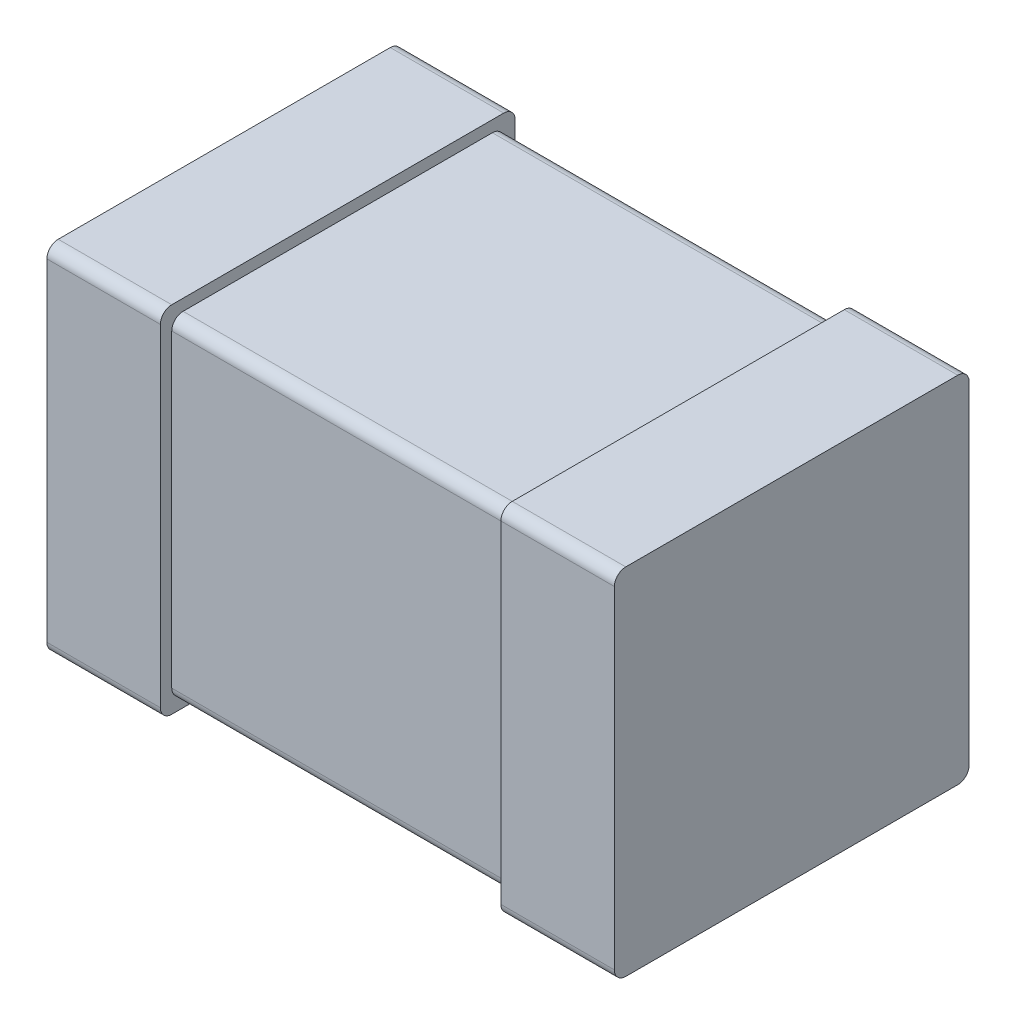
ISO-10303-21;
HEADER;
FILE_DESCRIPTION(('STEP AP214'),'2;1');
FILE_NAME('part.step','',(''),(''),'','','');
FILE_SCHEMA(('AUTOMOTIVE_DESIGN { 1 0 10303 214 1 1 1 1 }'));
ENDSEC;
DATA;
#1=APPLICATION_CONTEXT('core data for automotive mechanical design processes');
#2=APPLICATION_PROTOCOL_DEFINITION('international standard','automotive_design',2000,#1);
#3=PRODUCT_CONTEXT('',#1,'mechanical');
#4=PRODUCT('Part','Part','',(#3));
#5=PRODUCT_RELATED_PRODUCT_CATEGORY('part','',(#4));
#6=PRODUCT_DEFINITION_FORMATION('','',#4);
#7=PRODUCT_DEFINITION_CONTEXT('part definition',#1,'design');
#8=PRODUCT_DEFINITION('design','',#6,#7);
#9=PRODUCT_DEFINITION_SHAPE('','',#8);
#10=(LENGTH_UNIT() NAMED_UNIT(*) SI_UNIT(.MILLI.,.METRE.));
#11=(NAMED_UNIT(*) PLANE_ANGLE_UNIT() SI_UNIT($,.RADIAN.));
#12=(NAMED_UNIT(*) SI_UNIT($,.STERADIAN.) SOLID_ANGLE_UNIT());
#13=UNCERTAINTY_MEASURE_WITH_UNIT(LENGTH_MEASURE(1.E-05),#10,'distance_accuracy_value','');
#14=(GEOMETRIC_REPRESENTATION_CONTEXT(3) GLOBAL_UNCERTAINTY_ASSIGNED_CONTEXT((#13)) GLOBAL_UNIT_ASSIGNED_CONTEXT((#10,
#11,#12)) REPRESENTATION_CONTEXT('',''));
#15=CARTESIAN_POINT('',(0.,0.,0.));
#16=DIRECTION('',(0.,0.,1.));
#17=DIRECTION('',(1.,0.,0.));
#18=AXIS2_PLACEMENT_3D('',#15,#16,#17);
#19=CARTESIAN_POINT('',(-1.,-0.625,0.));
#20=DIRECTION('',(1.,0.,0.));
#21=DIRECTION('',(0.,1.,0.));
#22=AXIS2_PLACEMENT_3D('',#19,#20,#21);
#23=PLANE('',#22);
#24=CARTESIAN_POINT('',(-1.,-0.585,1.21));
#25=DIRECTION('',(-1.,0.,0.));
#26=DIRECTION('',(0.,0.,1.));
#27=AXIS2_PLACEMENT_3D('',#24,#25,#26);
#28=CIRCLE('',#27,0.04);
#29=CARTESIAN_POINT('',(-1.,-0.625,1.21));
#30=VERTEX_POINT('',#29);
#31=CARTESIAN_POINT('',(-1.,-0.585,1.25));
#32=VERTEX_POINT('',#31);
#33=EDGE_CURVE('E11',#30,#32,#28,.T.);
#34=ORIENTED_EDGE('',*,*,#33,.T.);
#35=DIRECTION('',(0.,1.,0.));
#36=VECTOR('',#35,1.);
#37=CARTESIAN_POINT('',(-1.,-0.625,1.25));
#38=LINE('',#37,#36);
#39=CARTESIAN_POINT('',(-1.,0.585,1.25));
#40=VERTEX_POINT('',#39);
#41=EDGE_CURVE('E27',#32,#40,#38,.T.);
#42=ORIENTED_EDGE('',*,*,#41,.T.);
#43=CARTESIAN_POINT('',(-1.,0.585,1.21));
#44=DIRECTION('',(1.,0.,0.));
#45=DIRECTION('',(0.,0.,1.));
#46=AXIS2_PLACEMENT_3D('',#43,#44,#45);
#47=CIRCLE('',#46,0.04);
#48=CARTESIAN_POINT('',(-1.,0.625,1.21));
#49=VERTEX_POINT('',#48);
#50=EDGE_CURVE('E371',#49,#40,#47,.T.);
#51=ORIENTED_EDGE('',*,*,#50,.F.);
#52=DIRECTION('',(0.,0.,1.));
#53=VECTOR('',#52,1.);
#54=CARTESIAN_POINT('',(-1.,0.625,0.));
#55=LINE('',#54,#53);
#56=CARTESIAN_POINT('',(-1.,0.625,0.04));
#57=VERTEX_POINT('',#56);
#58=EDGE_CURVE('E286',#57,#49,#55,.T.);
#59=ORIENTED_EDGE('',*,*,#58,.F.);
#60=CARTESIAN_POINT('',(-1.,0.585,0.04));
#61=DIRECTION('',(-1.,0.,0.));
#62=DIRECTION('',(0.,0.,1.));
#63=AXIS2_PLACEMENT_3D('',#60,#61,#62);
#64=CIRCLE('',#63,0.04);
#65=CARTESIAN_POINT('',(-1.,0.585,0.));
#66=VERTEX_POINT('',#65);
#67=EDGE_CURVE('E426',#57,#66,#64,.T.);
#68=ORIENTED_EDGE('',*,*,#67,.T.);
#69=DIRECTION('',(0.,1.,0.));
#70=VECTOR('',#69,1.);
#71=CARTESIAN_POINT('',(-1.,-0.625,0.));
#72=LINE('',#71,#70);
#73=CARTESIAN_POINT('',(-1.,-0.585,0.));
#74=VERTEX_POINT('',#73);
#75=EDGE_CURVE('E382',#74,#66,#72,.T.);
#76=ORIENTED_EDGE('',*,*,#75,.F.);
#77=CARTESIAN_POINT('',(-1.,-0.585,0.04));
#78=DIRECTION('',(1.,0.,0.));
#79=DIRECTION('',(0.,0.,1.));
#80=AXIS2_PLACEMENT_3D('',#77,#78,#79);
#81=CIRCLE('',#80,0.04);
#82=CARTESIAN_POINT('',(-1.,-0.625,0.04));
#83=VERTEX_POINT('',#82);
#84=EDGE_CURVE('E152',#83,#74,#81,.T.);
#85=ORIENTED_EDGE('',*,*,#84,.F.);
#86=DIRECTION('',(0.,0.,1.));
#87=VECTOR('',#86,1.);
#88=CARTESIAN_POINT('',(-1.,-0.625,0.));
#89=LINE('',#88,#87);
#90=EDGE_CURVE('E159',#83,#30,#89,.T.);
#91=ORIENTED_EDGE('',*,*,#90,.T.);
#92=EDGE_LOOP('',(#34,#42,#51,#59,#68,#76,#85,#91));
#93=FACE_BOUND('',#92,.T.);
#94=ADVANCED_FACE('F16',(#93),#23,.F.);
#95=CARTESIAN_POINT('',(-1.,-0.625,0.));
#96=DIRECTION('',(0.,1.,0.));
#97=DIRECTION('',(1.,0.,0.));
#98=AXIS2_PLACEMENT_3D('',#95,#96,#97);
#99=PLANE('',#98);
#100=DIRECTION('',(1.,0.,0.));
#101=VECTOR('',#100,1.);
#102=CARTESIAN_POINT('',(-1.,-0.625,1.21));
#103=LINE('',#102,#101);
#104=CARTESIAN_POINT('',(-0.6,-0.625,1.21));
#105=VERTEX_POINT('',#104);
#106=EDGE_CURVE('E338',#30,#105,#103,.T.);
#107=ORIENTED_EDGE('',*,*,#106,.F.);
#108=ORIENTED_EDGE('',*,*,#90,.F.);
#109=DIRECTION('',(1.,0.,0.));
#110=VECTOR('',#109,1.);
#111=CARTESIAN_POINT('',(-1.,-0.625,0.04));
#112=LINE('',#111,#110);
#113=CARTESIAN_POINT('',(-0.6,-0.625,0.04));
#114=VERTEX_POINT('',#113);
#115=EDGE_CURVE('E284',#83,#114,#112,.T.);
#116=ORIENTED_EDGE('',*,*,#115,.T.);
#117=DIRECTION('',(0.,0.,1.));
#118=VECTOR('',#117,1.);
#119=CARTESIAN_POINT('',(-0.6,-0.625,0.));
#120=LINE('',#119,#118);
#121=EDGE_CURVE('E340',#114,#105,#120,.T.);
#122=ORIENTED_EDGE('',*,*,#121,.T.);
#123=EDGE_LOOP('',(#107,#108,#116,#122));
#124=FACE_BOUND('',#123,.T.);
#125=ADVANCED_FACE('F547',(#124),#99,.F.);
#126=CARTESIAN_POINT('',(-1.,-0.585,0.04));
#127=DIRECTION('',(1.,0.,0.));
#128=DIRECTION('',(0.,-1.,0.));
#129=AXIS2_PLACEMENT_3D('',#126,#127,#128);
#130=CYLINDRICAL_SURFACE('',#129,0.04);
#131=ORIENTED_EDGE('',*,*,#84,.T.);
#132=DIRECTION('',(1.,0.,0.));
#133=VECTOR('',#132,1.);
#134=CARTESIAN_POINT('',(-1.,-0.585,0.));
#135=LINE('',#134,#133);
#136=CARTESIAN_POINT('',(-0.6,-0.585,0.));
#137=VERTEX_POINT('',#136);
#138=EDGE_CURVE('E334',#74,#137,#135,.T.);
#139=ORIENTED_EDGE('',*,*,#138,.T.);
#140=CARTESIAN_POINT('',(-0.6,-0.585,0.04));
#141=DIRECTION('',(1.,0.,0.));
#142=DIRECTION('',(0.,0.,1.));
#143=AXIS2_PLACEMENT_3D('',#140,#141,#142);
#144=CIRCLE('',#143,0.04);
#145=EDGE_CURVE('E386',#114,#137,#144,.T.);
#146=ORIENTED_EDGE('',*,*,#145,.F.);
#147=ORIENTED_EDGE('',*,*,#115,.F.);
#148=EDGE_LOOP('',(#131,#139,#146,#147));
#149=FACE_BOUND('',#148,.T.);
#150=ADVANCED_FACE('F18',(#149),#130,.T.);
#151=CARTESIAN_POINT('',(-1.,-0.585,1.21));
#152=DIRECTION('',(1.,0.,0.));
#153=DIRECTION('',(0.,-1.,0.));
#154=AXIS2_PLACEMENT_3D('',#151,#152,#153);
#155=CYLINDRICAL_SURFACE('',#154,0.04);
#156=ORIENTED_EDGE('',*,*,#106,.T.);
#157=CARTESIAN_POINT('',(-0.6,-0.585,1.21));
#158=DIRECTION('',(-1.,0.,0.));
#159=DIRECTION('',(0.,0.,1.));
#160=AXIS2_PLACEMENT_3D('',#157,#158,#159);
#161=CIRCLE('',#160,0.04);
#162=CARTESIAN_POINT('',(-0.6,-0.585,1.25));
#163=VERTEX_POINT('',#162);
#164=EDGE_CURVE('E381',#105,#163,#161,.T.);
#165=ORIENTED_EDGE('',*,*,#164,.T.);
#166=DIRECTION('',(1.,0.,0.));
#167=VECTOR('',#166,1.);
#168=CARTESIAN_POINT('',(-1.,-0.585,1.25));
#169=LINE('',#168,#167);
#170=EDGE_CURVE('E523',#32,#163,#169,.T.);
#171=ORIENTED_EDGE('',*,*,#170,.F.);
#172=ORIENTED_EDGE('',*,*,#33,.F.);
#173=EDGE_LOOP('',(#156,#165,#171,#172));
#174=FACE_BOUND('',#173,.T.);
#175=ADVANCED_FACE('F545',(#174),#155,.T.);
#176=CARTESIAN_POINT('',(-1.,-0.625,0.));
#177=DIRECTION('',(0.,0.,1.));
#178=DIRECTION('',(1.,0.,0.));
#179=AXIS2_PLACEMENT_3D('',#176,#177,#178);
#180=PLANE('',#179);
#181=DIRECTION('',(1.,0.,0.));
#182=VECTOR('',#181,1.);
#183=CARTESIAN_POINT('',(-1.,0.585,0.));
#184=LINE('',#183,#182);
#185=CARTESIAN_POINT('',(-0.6,0.585,0.));
#186=VERTEX_POINT('',#185);
#187=EDGE_CURVE('E377',#66,#186,#184,.T.);
#188=ORIENTED_EDGE('',*,*,#187,.T.);
#189=DIRECTION('',(0.,1.,0.));
#190=VECTOR('',#189,1.);
#191=CARTESIAN_POINT('',(-0.6,-0.625,0.));
#192=LINE('',#191,#190);
#193=EDGE_CURVE('E391',#137,#186,#192,.T.);
#194=ORIENTED_EDGE('',*,*,#193,.F.);
#195=ORIENTED_EDGE('',*,*,#138,.F.);
#196=ORIENTED_EDGE('',*,*,#75,.T.);
#197=EDGE_LOOP('',(#188,#194,#195,#196));
#198=FACE_BOUND('',#197,.T.);
#199=ADVANCED_FACE('F550',(#198),#180,.F.);
#200=CARTESIAN_POINT('',(-1.,-0.625,1.25));
#201=DIRECTION('',(0.,0.,1.));
#202=DIRECTION('',(1.,0.,0.));
#203=AXIS2_PLACEMENT_3D('',#200,#201,#202);
#204=PLANE('',#203);
#205=ORIENTED_EDGE('',*,*,#41,.F.);
#206=ORIENTED_EDGE('',*,*,#170,.T.);
#207=DIRECTION('',(0.,1.,0.));
#208=VECTOR('',#207,1.);
#209=CARTESIAN_POINT('',(-0.6,-0.625,1.25));
#210=LINE('',#209,#208);
#211=CARTESIAN_POINT('',(-0.6,0.585,1.25));
#212=VERTEX_POINT('',#211);
#213=EDGE_CURVE('E364',#163,#212,#210,.T.);
#214=ORIENTED_EDGE('',*,*,#213,.T.);
#215=DIRECTION('',(1.,0.,0.));
#216=VECTOR('',#215,1.);
#217=CARTESIAN_POINT('',(-1.,0.585,1.25));
#218=LINE('',#217,#216);
#219=EDGE_CURVE('E288',#40,#212,#218,.T.);
#220=ORIENTED_EDGE('',*,*,#219,.F.);
#221=EDGE_LOOP('',(#205,#206,#214,#220));
#222=FACE_BOUND('',#221,.T.);
#223=ADVANCED_FACE('F532',(#222),#204,.T.);
#224=CARTESIAN_POINT('',(-1.,0.585,0.04));
#225=DIRECTION('',(1.,0.,0.));
#226=DIRECTION('',(0.,1.,0.));
#227=AXIS2_PLACEMENT_3D('',#224,#225,#226);
#228=CYLINDRICAL_SURFACE('',#227,0.04);
#229=DIRECTION('',(1.,0.,0.));
#230=VECTOR('',#229,1.);
#231=CARTESIAN_POINT('',(-1.,0.625,0.04));
#232=LINE('',#231,#230);
#233=CARTESIAN_POINT('',(-0.6,0.625,0.04));
#234=VERTEX_POINT('',#233);
#235=EDGE_CURVE('E361',#57,#234,#232,.T.);
#236=ORIENTED_EDGE('',*,*,#235,.T.);
#237=CARTESIAN_POINT('',(-0.6,0.585,0.04));
#238=DIRECTION('',(-1.,0.,0.));
#239=DIRECTION('',(0.,0.,1.));
#240=AXIS2_PLACEMENT_3D('',#237,#238,#239);
#241=CIRCLE('',#240,0.04);
#242=EDGE_CURVE('E365',#234,#186,#241,.T.);
#243=ORIENTED_EDGE('',*,*,#242,.T.);
#244=ORIENTED_EDGE('',*,*,#187,.F.);
#245=ORIENTED_EDGE('',*,*,#67,.F.);
#246=EDGE_LOOP('',(#236,#243,#244,#245));
#247=FACE_BOUND('',#246,.T.);
#248=ADVANCED_FACE('F644',(#247),#228,.T.);
#249=CARTESIAN_POINT('',(-1.,0.585,1.21));
#250=DIRECTION('',(1.,0.,0.));
#251=DIRECTION('',(0.,1.,0.));
#252=AXIS2_PLACEMENT_3D('',#249,#250,#251);
#253=CYLINDRICAL_SURFACE('',#252,0.04);
#254=ORIENTED_EDGE('',*,*,#50,.T.);
#255=ORIENTED_EDGE('',*,*,#219,.T.);
#256=CARTESIAN_POINT('',(-0.6,0.585,1.21));
#257=DIRECTION('',(1.,0.,0.));
#258=DIRECTION('',(0.,0.,1.));
#259=AXIS2_PLACEMENT_3D('',#256,#257,#258);
#260=CIRCLE('',#259,0.04);
#261=CARTESIAN_POINT('',(-0.6,0.625,1.21));
#262=VERTEX_POINT('',#261);
#263=EDGE_CURVE('E392',#262,#212,#260,.T.);
#264=ORIENTED_EDGE('',*,*,#263,.F.);
#265=DIRECTION('',(1.,0.,0.));
#266=VECTOR('',#265,1.);
#267=CARTESIAN_POINT('',(-1.,0.625,1.21));
#268=LINE('',#267,#266);
#269=EDGE_CURVE('E289',#49,#262,#268,.T.);
#270=ORIENTED_EDGE('',*,*,#269,.F.);
#271=EDGE_LOOP('',(#254,#255,#264,#270));
#272=FACE_BOUND('',#271,.T.);
#273=ADVANCED_FACE('F539',(#272),#253,.T.);
#274=CARTESIAN_POINT('',(-1.,0.625,0.));
#275=DIRECTION('',(0.,1.,0.));
#276=DIRECTION('',(1.,0.,0.));
#277=AXIS2_PLACEMENT_3D('',#274,#275,#276);
#278=PLANE('',#277);
#279=DIRECTION('',(0.,0.,1.));
#280=VECTOR('',#279,1.);
#281=CARTESIAN_POINT('',(-0.6,0.625,0.));
#282=LINE('',#281,#280);
#283=EDGE_CURVE('E387',#234,#262,#282,.T.);
#284=ORIENTED_EDGE('',*,*,#283,.F.);
#285=ORIENTED_EDGE('',*,*,#235,.F.);
#286=ORIENTED_EDGE('',*,*,#58,.T.);
#287=ORIENTED_EDGE('',*,*,#269,.T.);
#288=EDGE_LOOP('',(#284,#285,#286,#287));
#289=FACE_BOUND('',#288,.T.);
#290=ADVANCED_FACE('F541',(#289),#278,.T.);
#291=CARTESIAN_POINT('',(-0.6,-0.625,0.));
#292=DIRECTION('',(1.,0.,0.));
#293=DIRECTION('',(0.,1.,0.));
#294=AXIS2_PLACEMENT_3D('',#291,#292,#293);
#295=PLANE('',#294);
#296=ORIENTED_EDGE('',*,*,#121,.F.);
#297=ORIENTED_EDGE('',*,*,#145,.T.);
#298=ORIENTED_EDGE('',*,*,#193,.T.);
#299=ORIENTED_EDGE('',*,*,#242,.F.);
#300=ORIENTED_EDGE('',*,*,#283,.T.);
#301=ORIENTED_EDGE('',*,*,#263,.T.);
#302=ORIENTED_EDGE('',*,*,#213,.F.);
#303=ORIENTED_EDGE('',*,*,#164,.F.);
#304=EDGE_LOOP('',(#296,#297,#298,#299,#300,#301,#302,#303));
#305=FACE_BOUND('',#304,.T.);
#306=CARTESIAN_POINT('',(-0.6,-0.545,0.08));
#307=DIRECTION('',(1.,0.,0.));
#308=DIRECTION('',(0.,0.,1.));
#309=AXIS2_PLACEMENT_3D('',#306,#307,#308);
#310=CIRCLE('',#309,0.04);
#311=CARTESIAN_POINT('',(-0.6,-0.585,0.08));
#312=VERTEX_POINT('',#311);
#313=CARTESIAN_POINT('',(-0.6,-0.545,0.04));
#314=VERTEX_POINT('',#313);
#315=EDGE_CURVE('E332',#312,#314,#310,.T.);
#316=ORIENTED_EDGE('',*,*,#315,.F.);
#317=DIRECTION('',(0.,0.,1.));
#318=VECTOR('',#317,1.);
#319=CARTESIAN_POINT('',(-0.6,-0.585,0.04));
#320=LINE('',#319,#318);
#321=CARTESIAN_POINT('',(-0.6,-0.585,1.17));
#322=VERTEX_POINT('',#321);
#323=EDGE_CURVE('E398',#312,#322,#320,.T.);
#324=ORIENTED_EDGE('',*,*,#323,.T.);
#325=CARTESIAN_POINT('',(-0.6,-0.545,1.17));
#326=DIRECTION('',(-1.,0.,0.));
#327=DIRECTION('',(0.,0.,1.));
#328=AXIS2_PLACEMENT_3D('',#325,#326,#327);
#329=CIRCLE('',#328,0.04);
#330=CARTESIAN_POINT('',(-0.6,-0.545,1.21));
#331=VERTEX_POINT('',#330);
#332=EDGE_CURVE('E449',#322,#331,#329,.T.);
#333=ORIENTED_EDGE('',*,*,#332,.T.);
#334=DIRECTION('',(0.,1.,0.));
#335=VECTOR('',#334,1.);
#336=CARTESIAN_POINT('',(-0.6,-0.585,1.21));
#337=LINE('',#336,#335);
#338=CARTESIAN_POINT('',(-0.6,0.545,1.21));
#339=VERTEX_POINT('',#338);
#340=EDGE_CURVE('E331',#331,#339,#337,.T.);
#341=ORIENTED_EDGE('',*,*,#340,.T.);
#342=CARTESIAN_POINT('',(-0.6,0.545,1.17));
#343=DIRECTION('',(1.,0.,0.));
#344=DIRECTION('',(0.,0.,1.));
#345=AXIS2_PLACEMENT_3D('',#342,#343,#344);
#346=CIRCLE('',#345,0.04);
#347=CARTESIAN_POINT('',(-0.6,0.585,1.17));
#348=VERTEX_POINT('',#347);
#349=EDGE_CURVE('E327',#348,#339,#346,.T.);
#350=ORIENTED_EDGE('',*,*,#349,.F.);
#351=DIRECTION('',(0.,0.,1.));
#352=VECTOR('',#351,1.);
#353=CARTESIAN_POINT('',(-0.6,0.585,0.04));
#354=LINE('',#353,#352);
#355=CARTESIAN_POINT('',(-0.6,0.585,0.08));
#356=VERTEX_POINT('',#355);
#357=EDGE_CURVE('E376',#356,#348,#354,.T.);
#358=ORIENTED_EDGE('',*,*,#357,.F.);
#359=CARTESIAN_POINT('',(-0.6,0.545,0.08));
#360=DIRECTION('',(-1.,0.,0.));
#361=DIRECTION('',(0.,0.,1.));
#362=AXIS2_PLACEMENT_3D('',#359,#360,#361);
#363=CIRCLE('',#362,0.04);
#364=CARTESIAN_POINT('',(-0.6,0.545,0.04));
#365=VERTEX_POINT('',#364);
#366=EDGE_CURVE('E328',#356,#365,#363,.T.);
#367=ORIENTED_EDGE('',*,*,#366,.T.);
#368=DIRECTION('',(0.,1.,0.));
#369=VECTOR('',#368,1.);
#370=CARTESIAN_POINT('',(-0.6,-0.585,0.04));
#371=LINE('',#370,#369);
#372=EDGE_CURVE('E294',#314,#365,#371,.T.);
#373=ORIENTED_EDGE('',*,*,#372,.F.);
#374=EDGE_LOOP('',(#316,#324,#333,#341,#350,#358,#367,#373));
#375=FACE_BOUND('',#374,.T.);
#376=ADVANCED_FACE('F534',(#305,#375),#295,.T.);
#377=CARTESIAN_POINT('',(-0.6,-0.545,0.08));
#378=DIRECTION('',(1.,0.,0.));
#379=DIRECTION('',(0.,-1.,0.));
#380=AXIS2_PLACEMENT_3D('',#377,#378,#379);
#381=CYLINDRICAL_SURFACE('',#380,0.04);
#382=ORIENTED_EDGE('',*,*,#315,.T.);
#383=DIRECTION('',(1.,0.,0.));
#384=VECTOR('',#383,1.);
#385=CARTESIAN_POINT('',(-0.6,-0.545,0.04));
#386=LINE('',#385,#384);
#387=CARTESIAN_POINT('',(0.6,-0.545,0.04));
#388=VERTEX_POINT('',#387);
#389=EDGE_CURVE('E293',#314,#388,#386,.T.);
#390=ORIENTED_EDGE('',*,*,#389,.T.);
#391=CARTESIAN_POINT('',(0.6,-0.545,0.08));
#392=DIRECTION('',(1.,0.,0.));
#393=DIRECTION('',(0.,0.,1.));
#394=AXIS2_PLACEMENT_3D('',#391,#392,#393);
#395=CIRCLE('',#394,0.04);
#396=CARTESIAN_POINT('',(0.6,-0.585,0.08));
#397=VERTEX_POINT('',#396);
#398=EDGE_CURVE('E221',#397,#388,#395,.T.);
#399=ORIENTED_EDGE('',*,*,#398,.F.);
#400=DIRECTION('',(1.,0.,0.));
#401=VECTOR('',#400,1.);
#402=CARTESIAN_POINT('',(-0.6,-0.585,0.08));
#403=LINE('',#402,#401);
#404=EDGE_CURVE('E322',#312,#397,#403,.T.);
#405=ORIENTED_EDGE('',*,*,#404,.F.);
#406=EDGE_LOOP('',(#382,#390,#399,#405));
#407=FACE_BOUND('',#406,.T.);
#408=ADVANCED_FACE('F636',(#407),#381,.T.);
#409=CARTESIAN_POINT('',(-0.6,-0.585,0.04));
#410=DIRECTION('',(0.,0.,1.));
#411=DIRECTION('',(1.,0.,0.));
#412=AXIS2_PLACEMENT_3D('',#409,#410,#411);
#413=PLANE('',#412);
#414=DIRECTION('',(1.,0.,0.));
#415=VECTOR('',#414,1.);
#416=CARTESIAN_POINT('',(-0.6,0.545,0.04));
#417=LINE('',#416,#415);
#418=CARTESIAN_POINT('',(0.6,0.545,0.04));
#419=VERTEX_POINT('',#418);
#420=EDGE_CURVE('E290',#365,#419,#417,.T.);
#421=ORIENTED_EDGE('',*,*,#420,.T.);
#422=DIRECTION('',(0.,1.,0.));
#423=VECTOR('',#422,1.);
#424=CARTESIAN_POINT('',(0.6,-0.585,0.04));
#425=LINE('',#424,#423);
#426=EDGE_CURVE('E230',#388,#419,#425,.T.);
#427=ORIENTED_EDGE('',*,*,#426,.F.);
#428=ORIENTED_EDGE('',*,*,#389,.F.);
#429=ORIENTED_EDGE('',*,*,#372,.T.);
#430=EDGE_LOOP('',(#421,#427,#428,#429));
#431=FACE_BOUND('',#430,.T.);
#432=ADVANCED_FACE('F585',(#431),#413,.F.);
#433=CARTESIAN_POINT('',(-0.6,0.545,0.08));
#434=DIRECTION('',(1.,0.,0.));
#435=DIRECTION('',(0.,1.,0.));
#436=AXIS2_PLACEMENT_3D('',#433,#434,#435);
#437=CYLINDRICAL_SURFACE('',#436,0.04);
#438=DIRECTION('',(1.,0.,0.));
#439=VECTOR('',#438,1.);
#440=CARTESIAN_POINT('',(-0.6,0.585,0.08));
#441=LINE('',#440,#439);
#442=CARTESIAN_POINT('',(0.6,0.585,0.08));
#443=VERTEX_POINT('',#442);
#444=EDGE_CURVE('E415',#356,#443,#441,.T.);
#445=ORIENTED_EDGE('',*,*,#444,.T.);
#446=CARTESIAN_POINT('',(0.6,0.545,0.08));
#447=DIRECTION('',(-1.,0.,0.));
#448=DIRECTION('',(0.,0.,1.));
#449=AXIS2_PLACEMENT_3D('',#446,#447,#448);
#450=CIRCLE('',#449,0.04);
#451=EDGE_CURVE('E458',#443,#419,#450,.T.);
#452=ORIENTED_EDGE('',*,*,#451,.T.);
#453=ORIENTED_EDGE('',*,*,#420,.F.);
#454=ORIENTED_EDGE('',*,*,#366,.F.);
#455=EDGE_LOOP('',(#445,#452,#453,#454));
#456=FACE_BOUND('',#455,.T.);
#457=ADVANCED_FACE('F580',(#456),#437,.T.);
#458=CARTESIAN_POINT('',(-0.6,0.585,0.04));
#459=DIRECTION('',(0.,1.,0.));
#460=DIRECTION('',(1.,0.,0.));
#461=AXIS2_PLACEMENT_3D('',#458,#459,#460);
#462=PLANE('',#461);
#463=DIRECTION('',(0.,0.,1.));
#464=VECTOR('',#463,1.);
#465=CARTESIAN_POINT('',(0.6,0.585,0.04));
#466=LINE('',#465,#464);
#467=CARTESIAN_POINT('',(0.6,0.585,1.17));
#468=VERTEX_POINT('',#467);
#469=EDGE_CURVE('E297',#443,#468,#466,.T.);
#470=ORIENTED_EDGE('',*,*,#469,.F.);
#471=ORIENTED_EDGE('',*,*,#444,.F.);
#472=ORIENTED_EDGE('',*,*,#357,.T.);
#473=DIRECTION('',(1.,0.,0.));
#474=VECTOR('',#473,1.);
#475=CARTESIAN_POINT('',(-0.6,0.585,1.17));
#476=LINE('',#475,#474);
#477=EDGE_CURVE('E372',#348,#468,#476,.T.);
#478=ORIENTED_EDGE('',*,*,#477,.T.);
#479=EDGE_LOOP('',(#470,#471,#472,#478));
#480=FACE_BOUND('',#479,.T.);
#481=ADVANCED_FACE('F584',(#480),#462,.T.);
#482=CARTESIAN_POINT('',(-0.6,0.545,1.17));
#483=DIRECTION('',(1.,0.,0.));
#484=DIRECTION('',(0.,1.,0.));
#485=AXIS2_PLACEMENT_3D('',#482,#483,#484);
#486=CYLINDRICAL_SURFACE('',#485,0.04);
#487=ORIENTED_EDGE('',*,*,#349,.T.);
#488=DIRECTION('',(1.,0.,0.));
#489=VECTOR('',#488,1.);
#490=CARTESIAN_POINT('',(-0.6,0.545,1.21));
#491=LINE('',#490,#489);
#492=CARTESIAN_POINT('',(0.6,0.545,1.21));
#493=VERTEX_POINT('',#492);
#494=EDGE_CURVE('E323',#339,#493,#491,.T.);
#495=ORIENTED_EDGE('',*,*,#494,.T.);
#496=CARTESIAN_POINT('',(0.6,0.545,1.17));
#497=DIRECTION('',(1.,0.,0.));
#498=DIRECTION('',(0.,0.,1.));
#499=AXIS2_PLACEMENT_3D('',#496,#497,#498);
#500=CIRCLE('',#499,0.04);
#501=EDGE_CURVE('E504',#468,#493,#500,.T.);
#502=ORIENTED_EDGE('',*,*,#501,.F.);
#503=ORIENTED_EDGE('',*,*,#477,.F.);
#504=EDGE_LOOP('',(#487,#495,#502,#503));
#505=FACE_BOUND('',#504,.T.);
#506=ADVANCED_FACE('F704',(#505),#486,.T.);
#507=CARTESIAN_POINT('',(-0.6,-0.585,1.21));
#508=DIRECTION('',(0.,0.,1.));
#509=DIRECTION('',(1.,0.,0.));
#510=AXIS2_PLACEMENT_3D('',#507,#508,#509);
#511=PLANE('',#510);
#512=ORIENTED_EDGE('',*,*,#340,.F.);
#513=DIRECTION('',(1.,0.,0.));
#514=VECTOR('',#513,1.);
#515=CARTESIAN_POINT('',(-0.6,-0.545,1.21));
#516=LINE('',#515,#514);
#517=CARTESIAN_POINT('',(0.6,-0.545,1.21));
#518=VERTEX_POINT('',#517);
#519=EDGE_CURVE('E302',#331,#518,#516,.T.);
#520=ORIENTED_EDGE('',*,*,#519,.T.);
#521=DIRECTION('',(0.,1.,0.));
#522=VECTOR('',#521,1.);
#523=CARTESIAN_POINT('',(0.6,-0.585,1.21));
#524=LINE('',#523,#522);
#525=EDGE_CURVE('E298',#518,#493,#524,.T.);
#526=ORIENTED_EDGE('',*,*,#525,.T.);
#527=ORIENTED_EDGE('',*,*,#494,.F.);
#528=EDGE_LOOP('',(#512,#520,#526,#527));
#529=FACE_BOUND('',#528,.T.);
#530=ADVANCED_FACE('F573',(#529),#511,.T.);
#531=CARTESIAN_POINT('',(-0.6,-0.545,1.17));
#532=DIRECTION('',(1.,0.,0.));
#533=DIRECTION('',(0.,-1.,0.));
#534=AXIS2_PLACEMENT_3D('',#531,#532,#533);
#535=CYLINDRICAL_SURFACE('',#534,0.04);
#536=DIRECTION('',(1.,0.,0.));
#537=VECTOR('',#536,1.);
#538=CARTESIAN_POINT('',(-0.6,-0.585,1.17));
#539=LINE('',#538,#537);
#540=CARTESIAN_POINT('',(0.6,-0.585,1.17));
#541=VERTEX_POINT('',#540);
#542=EDGE_CURVE('E303',#322,#541,#539,.T.);
#543=ORIENTED_EDGE('',*,*,#542,.T.);
#544=CARTESIAN_POINT('',(0.6,-0.545,1.17));
#545=DIRECTION('',(-1.,0.,0.));
#546=DIRECTION('',(0.,0.,1.));
#547=AXIS2_PLACEMENT_3D('',#544,#545,#546);
#548=CIRCLE('',#547,0.04);
#549=EDGE_CURVE('E307',#541,#518,#548,.T.);
#550=ORIENTED_EDGE('',*,*,#549,.T.);
#551=ORIENTED_EDGE('',*,*,#519,.F.);
#552=ORIENTED_EDGE('',*,*,#332,.F.);
#553=EDGE_LOOP('',(#543,#550,#551,#552));
#554=FACE_BOUND('',#553,.T.);
#555=ADVANCED_FACE('F568',(#554),#535,.T.);
#556=CARTESIAN_POINT('',(-0.6,-0.585,0.04));
#557=DIRECTION('',(0.,1.,0.));
#558=DIRECTION('',(1.,0.,0.));
#559=AXIS2_PLACEMENT_3D('',#556,#557,#558);
#560=PLANE('',#559);
#561=ORIENTED_EDGE('',*,*,#542,.F.);
#562=ORIENTED_EDGE('',*,*,#323,.F.);
#563=ORIENTED_EDGE('',*,*,#404,.T.);
#564=DIRECTION('',(0.,0.,1.));
#565=VECTOR('',#564,1.);
#566=CARTESIAN_POINT('',(0.6,-0.585,0.04));
#567=LINE('',#566,#565);
#568=EDGE_CURVE('E263',#397,#541,#567,.T.);
#569=ORIENTED_EDGE('',*,*,#568,.T.);
#570=EDGE_LOOP('',(#561,#562,#563,#569));
#571=FACE_BOUND('',#570,.T.);
#572=ADVANCED_FACE('F572',(#571),#560,.F.);
#573=CARTESIAN_POINT('',(0.6,-0.625,0.));
#574=DIRECTION('',(1.,0.,0.));
#575=DIRECTION('',(0.,1.,0.));
#576=AXIS2_PLACEMENT_3D('',#573,#574,#575);
#577=PLANE('',#576);
#578=CARTESIAN_POINT('',(0.6,-0.585,1.21));
#579=DIRECTION('',(-1.,0.,0.));
#580=DIRECTION('',(0.,0.,1.));
#581=AXIS2_PLACEMENT_3D('',#578,#579,#580);
#582=CIRCLE('',#581,0.04);
#583=CARTESIAN_POINT('',(0.6,-0.625,1.21));
#584=VERTEX_POINT('',#583);
#585=CARTESIAN_POINT('',(0.6,-0.585,1.25));
#586=VERTEX_POINT('',#585);
#587=EDGE_CURVE('E245',#584,#586,#582,.T.);
#588=ORIENTED_EDGE('',*,*,#587,.T.);
#589=DIRECTION('',(0.,1.,0.));
#590=VECTOR('',#589,1.);
#591=CARTESIAN_POINT('',(0.6,-0.625,1.25));
#592=LINE('',#591,#590);
#593=CARTESIAN_POINT('',(0.6,0.585,1.25));
#594=VERTEX_POINT('',#593);
#595=EDGE_CURVE('E264',#586,#594,#592,.T.);
#596=ORIENTED_EDGE('',*,*,#595,.T.);
#597=CARTESIAN_POINT('',(0.6,0.585,1.21));
#598=DIRECTION('',(1.,0.,0.));
#599=DIRECTION('',(0.,0.,1.));
#600=AXIS2_PLACEMENT_3D('',#597,#598,#599);
#601=CIRCLE('',#600,0.04);
#602=CARTESIAN_POINT('',(0.6,0.625,1.21));
#603=VERTEX_POINT('',#602);
#604=EDGE_CURVE('E318',#603,#594,#601,.T.);
#605=ORIENTED_EDGE('',*,*,#604,.F.);
#606=DIRECTION('',(0.,0.,1.));
#607=VECTOR('',#606,1.);
#608=CARTESIAN_POINT('',(0.6,0.625,0.));
#609=LINE('',#608,#607);
#610=CARTESIAN_POINT('',(0.6,0.625,0.04));
#611=VERTEX_POINT('',#610);
#612=EDGE_CURVE('E308',#611,#603,#609,.T.);
#613=ORIENTED_EDGE('',*,*,#612,.F.);
#614=CARTESIAN_POINT('',(0.6,0.585,0.04));
#615=DIRECTION('',(-1.,0.,0.));
#616=DIRECTION('',(0.,0.,1.));
#617=AXIS2_PLACEMENT_3D('',#614,#615,#616);
#618=CIRCLE('',#617,0.04);
#619=CARTESIAN_POINT('',(0.6,0.585,0.));
#620=VERTEX_POINT('',#619);
#621=EDGE_CURVE('E254',#611,#620,#618,.T.);
#622=ORIENTED_EDGE('',*,*,#621,.T.);
#623=DIRECTION('',(0.,1.,0.));
#624=VECTOR('',#623,1.);
#625=CARTESIAN_POINT('',(0.6,-0.625,0.));
#626=LINE('',#625,#624);
#627=CARTESIAN_POINT('',(0.6,-0.585,0.));
#628=VERTEX_POINT('',#627);
#629=EDGE_CURVE('E402',#628,#620,#626,.T.);
#630=ORIENTED_EDGE('',*,*,#629,.F.);
#631=CARTESIAN_POINT('',(0.6,-0.585,0.04));
#632=DIRECTION('',(1.,0.,0.));
#633=DIRECTION('',(0.,0.,1.));
#634=AXIS2_PLACEMENT_3D('',#631,#632,#633);
#635=CIRCLE('',#634,0.04);
#636=CARTESIAN_POINT('',(0.6,-0.625,0.04));
#637=VERTEX_POINT('',#636);
#638=EDGE_CURVE('E248',#637,#628,#635,.T.);
#639=ORIENTED_EDGE('',*,*,#638,.F.);
#640=DIRECTION('',(0.,0.,1.));
#641=VECTOR('',#640,1.);
#642=CARTESIAN_POINT('',(0.6,-0.625,0.));
#643=LINE('',#642,#641);
#644=EDGE_CURVE('E241',#637,#584,#643,.T.);
#645=ORIENTED_EDGE('',*,*,#644,.T.);
#646=EDGE_LOOP('',(#588,#596,#605,#613,#622,#630,#639,#645));
#647=FACE_BOUND('',#646,.T.);
#648=ORIENTED_EDGE('',*,*,#426,.T.);
#649=ORIENTED_EDGE('',*,*,#451,.F.);
#650=ORIENTED_EDGE('',*,*,#469,.T.);
#651=ORIENTED_EDGE('',*,*,#501,.T.);
#652=ORIENTED_EDGE('',*,*,#525,.F.);
#653=ORIENTED_EDGE('',*,*,#549,.F.);
#654=ORIENTED_EDGE('',*,*,#568,.F.);
#655=ORIENTED_EDGE('',*,*,#398,.T.);
#656=EDGE_LOOP('',(#648,#649,#650,#651,#652,#653,#654,#655));
#657=FACE_BOUND('',#656,.T.);
#658=ADVANCED_FACE('F243',(#647,#657),#577,.F.);
#659=CARTESIAN_POINT('',(0.6,-0.625,0.));
#660=DIRECTION('',(0.,1.,0.));
#661=DIRECTION('',(1.,0.,0.));
#662=AXIS2_PLACEMENT_3D('',#659,#660,#661);
#663=PLANE('',#662);
#664=DIRECTION('',(1.,0.,0.));
#665=VECTOR('',#664,1.);
#666=CARTESIAN_POINT('',(0.6,-0.625,1.21));
#667=LINE('',#666,#665);
#668=CARTESIAN_POINT('',(1.,-0.625,1.21));
#669=VERTEX_POINT('',#668);
#670=EDGE_CURVE('E259',#584,#669,#667,.T.);
#671=ORIENTED_EDGE('',*,*,#670,.F.);
#672=ORIENTED_EDGE('',*,*,#644,.F.);
#673=DIRECTION('',(1.,0.,0.));
#674=VECTOR('',#673,1.);
#675=CARTESIAN_POINT('',(0.6,-0.625,0.04));
#676=LINE('',#675,#674);
#677=CARTESIAN_POINT('',(1.,-0.625,0.04));
#678=VERTEX_POINT('',#677);
#679=EDGE_CURVE('E366',#637,#678,#676,.T.);
#680=ORIENTED_EDGE('',*,*,#679,.T.);
#681=DIRECTION('',(0.,0.,1.));
#682=VECTOR('',#681,1.);
#683=CARTESIAN_POINT('',(1.,-0.625,0.));
#684=LINE('',#683,#682);
#685=EDGE_CURVE('E267',#678,#669,#684,.T.);
#686=ORIENTED_EDGE('',*,*,#685,.T.);
#687=EDGE_LOOP('',(#671,#672,#680,#686));
#688=FACE_BOUND('',#687,.T.);
#689=ADVANCED_FACE('F266',(#688),#663,.F.);
#690=CARTESIAN_POINT('',(0.6,-0.585,0.04));
#691=DIRECTION('',(1.,0.,0.));
#692=DIRECTION('',(0.,-1.,0.));
#693=AXIS2_PLACEMENT_3D('',#690,#691,#692);
#694=CYLINDRICAL_SURFACE('',#693,0.04);
#695=ORIENTED_EDGE('',*,*,#638,.T.);
#696=DIRECTION('',(1.,0.,0.));
#697=VECTOR('',#696,1.);
#698=CARTESIAN_POINT('',(0.6,-0.585,0.));
#699=LINE('',#698,#697);
#700=CARTESIAN_POINT('',(1.,-0.585,0.));
#701=VERTEX_POINT('',#700);
#702=EDGE_CURVE('E270',#628,#701,#699,.T.);
#703=ORIENTED_EDGE('',*,*,#702,.T.);
#704=CARTESIAN_POINT('',(1.,-0.585,0.04));
#705=DIRECTION('',(1.,0.,0.));
#706=DIRECTION('',(0.,0.,1.));
#707=AXIS2_PLACEMENT_3D('',#704,#705,#706);
#708=CIRCLE('',#707,0.04);
#709=EDGE_CURVE('E474',#678,#701,#708,.T.);
#710=ORIENTED_EDGE('',*,*,#709,.F.);
#711=ORIENTED_EDGE('',*,*,#679,.F.);
#712=EDGE_LOOP('',(#695,#703,#710,#711));
#713=FACE_BOUND('',#712,.T.);
#714=ADVANCED_FACE('F673',(#713),#694,.T.);
#715=CARTESIAN_POINT('',(0.6,-0.585,1.21));
#716=DIRECTION('',(1.,0.,0.));
#717=DIRECTION('',(0.,-1.,0.));
#718=AXIS2_PLACEMENT_3D('',#715,#716,#717);
#719=CYLINDRICAL_SURFACE('',#718,0.04);
#720=ORIENTED_EDGE('',*,*,#670,.T.);
#721=CARTESIAN_POINT('',(1.,-0.585,1.21));
#722=DIRECTION('',(-1.,0.,0.));
#723=DIRECTION('',(0.,0.,1.));
#724=AXIS2_PLACEMENT_3D('',#721,#722,#723);
#725=CIRCLE('',#724,0.04);
#726=CARTESIAN_POINT('',(1.,-0.585,1.25));
#727=VERTEX_POINT('',#726);
#728=EDGE_CURVE('E271',#669,#727,#725,.T.);
#729=ORIENTED_EDGE('',*,*,#728,.T.);
#730=DIRECTION('',(1.,0.,0.));
#731=VECTOR('',#730,1.);
#732=CARTESIAN_POINT('',(0.6,-0.585,1.25));
#733=LINE('',#732,#731);
#734=EDGE_CURVE('E261',#586,#727,#733,.T.);
#735=ORIENTED_EDGE('',*,*,#734,.F.);
#736=ORIENTED_EDGE('',*,*,#587,.F.);
#737=EDGE_LOOP('',(#720,#729,#735,#736));
#738=FACE_BOUND('',#737,.T.);
#739=ADVANCED_FACE('F257',(#738),#719,.T.);
#740=CARTESIAN_POINT('',(0.6,-0.625,0.));
#741=DIRECTION('',(0.,0.,1.));
#742=DIRECTION('',(1.,0.,0.));
#743=AXIS2_PLACEMENT_3D('',#740,#741,#742);
#744=PLANE('',#743);
#745=DIRECTION('',(1.,0.,0.));
#746=VECTOR('',#745,1.);
#747=CARTESIAN_POINT('',(0.6,0.585,0.));
#748=LINE('',#747,#746);
#749=CARTESIAN_POINT('',(1.,0.585,0.));
#750=VERTEX_POINT('',#749);
#751=EDGE_CURVE('E280',#620,#750,#748,.T.);
#752=ORIENTED_EDGE('',*,*,#751,.T.);
#753=DIRECTION('',(0.,1.,0.));
#754=VECTOR('',#753,1.);
#755=CARTESIAN_POINT('',(1.,-0.625,0.));
#756=LINE('',#755,#754);
#757=EDGE_CURVE('E475',#701,#750,#756,.T.);
#758=ORIENTED_EDGE('',*,*,#757,.F.);
#759=ORIENTED_EDGE('',*,*,#702,.F.);
#760=ORIENTED_EDGE('',*,*,#629,.T.);
#761=EDGE_LOOP('',(#752,#758,#759,#760));
#762=FACE_BOUND('',#761,.T.);
#763=ADVANCED_FACE('F593',(#762),#744,.F.);
#764=CARTESIAN_POINT('',(0.6,-0.625,1.25));
#765=DIRECTION('',(0.,0.,1.));
#766=DIRECTION('',(1.,0.,0.));
#767=AXIS2_PLACEMENT_3D('',#764,#765,#766);
#768=PLANE('',#767);
#769=ORIENTED_EDGE('',*,*,#595,.F.);
#770=ORIENTED_EDGE('',*,*,#734,.T.);
#771=DIRECTION('',(0.,1.,0.));
#772=VECTOR('',#771,1.);
#773=CARTESIAN_POINT('',(1.,-0.625,1.25));
#774=LINE('',#773,#772);
#775=CARTESIAN_POINT('',(1.,0.585,1.25));
#776=VERTEX_POINT('',#775);
#777=EDGE_CURVE('E20',#727,#776,#774,.T.);
#778=ORIENTED_EDGE('',*,*,#777,.T.);
#779=DIRECTION('',(1.,0.,0.));
#780=VECTOR('',#779,1.);
#781=CARTESIAN_POINT('',(0.6,0.585,1.25));
#782=LINE('',#781,#780);
#783=EDGE_CURVE('E310',#594,#776,#782,.T.);
#784=ORIENTED_EDGE('',*,*,#783,.F.);
#785=EDGE_LOOP('',(#769,#770,#778,#784));
#786=FACE_BOUND('',#785,.T.);
#787=ADVANCED_FACE('F597',(#786),#768,.T.);
#788=CARTESIAN_POINT('',(0.6,0.585,0.04));
#789=DIRECTION('',(1.,0.,0.));
#790=DIRECTION('',(0.,1.,0.));
#791=AXIS2_PLACEMENT_3D('',#788,#789,#790);
#792=CYLINDRICAL_SURFACE('',#791,0.04);
#793=DIRECTION('',(1.,0.,0.));
#794=VECTOR('',#793,1.);
#795=CARTESIAN_POINT('',(0.6,0.625,0.04));
#796=LINE('',#795,#794);
#797=CARTESIAN_POINT('',(1.,0.625,0.04));
#798=VERTEX_POINT('',#797);
#799=EDGE_CURVE('E317',#611,#798,#796,.T.);
#800=ORIENTED_EDGE('',*,*,#799,.T.);
#801=CARTESIAN_POINT('',(1.,0.585,0.04));
#802=DIRECTION('',(-1.,0.,0.));
#803=DIRECTION('',(0.,0.,1.));
#804=AXIS2_PLACEMENT_3D('',#801,#802,#803);
#805=CIRCLE('',#804,0.04);
#806=EDGE_CURVE('E313',#798,#750,#805,.T.);
#807=ORIENTED_EDGE('',*,*,#806,.T.);
#808=ORIENTED_EDGE('',*,*,#751,.F.);
#809=ORIENTED_EDGE('',*,*,#621,.F.);
#810=EDGE_LOOP('',(#800,#807,#808,#809));
#811=FACE_BOUND('',#810,.T.);
#812=ADVANCED_FACE('F626',(#811),#792,.T.);
#813=CARTESIAN_POINT('',(0.6,0.585,1.21));
#814=DIRECTION('',(1.,0.,0.));
#815=DIRECTION('',(0.,1.,0.));
#816=AXIS2_PLACEMENT_3D('',#813,#814,#815);
#817=CYLINDRICAL_SURFACE('',#816,0.04);
#818=ORIENTED_EDGE('',*,*,#604,.T.);
#819=ORIENTED_EDGE('',*,*,#783,.T.);
#820=CARTESIAN_POINT('',(1.,0.585,1.21));
#821=DIRECTION('',(1.,0.,0.));
#822=DIRECTION('',(0.,0.,1.));
#823=AXIS2_PLACEMENT_3D('',#820,#821,#822);
#824=CIRCLE('',#823,0.04);
#825=CARTESIAN_POINT('',(1.,0.625,1.21));
#826=VERTEX_POINT('',#825);
#827=EDGE_CURVE('E408',#826,#776,#824,.T.);
#828=ORIENTED_EDGE('',*,*,#827,.F.);
#829=DIRECTION('',(1.,0.,0.));
#830=VECTOR('',#829,1.);
#831=CARTESIAN_POINT('',(0.6,0.625,1.21));
#832=LINE('',#831,#830);
#833=EDGE_CURVE('E311',#603,#826,#832,.T.);
#834=ORIENTED_EDGE('',*,*,#833,.F.);
#835=EDGE_LOOP('',(#818,#819,#828,#834));
#836=FACE_BOUND('',#835,.T.);
#837=ADVANCED_FACE('F616',(#836),#817,.T.);
#838=CARTESIAN_POINT('',(0.6,0.625,0.));
#839=DIRECTION('',(0.,1.,0.));
#840=DIRECTION('',(1.,0.,0.));
#841=AXIS2_PLACEMENT_3D('',#838,#839,#840);
#842=PLANE('',#841);
#843=DIRECTION('',(0.,0.,1.));
#844=VECTOR('',#843,1.);
#845=CARTESIAN_POINT('',(1.,0.625,0.));
#846=LINE('',#845,#844);
#847=EDGE_CURVE('E359',#798,#826,#846,.T.);
#848=ORIENTED_EDGE('',*,*,#847,.F.);
#849=ORIENTED_EDGE('',*,*,#799,.F.);
#850=ORIENTED_EDGE('',*,*,#612,.T.);
#851=ORIENTED_EDGE('',*,*,#833,.T.);
#852=EDGE_LOOP('',(#848,#849,#850,#851));
#853=FACE_BOUND('',#852,.T.);
#854=ADVANCED_FACE('F611',(#853),#842,.T.);
#855=CARTESIAN_POINT('',(1.,-0.625,0.));
#856=DIRECTION('',(1.,0.,0.));
#857=DIRECTION('',(0.,1.,0.));
#858=AXIS2_PLACEMENT_3D('',#855,#856,#857);
#859=PLANE('',#858);
#860=ORIENTED_EDGE('',*,*,#685,.F.);
#861=ORIENTED_EDGE('',*,*,#709,.T.);
#862=ORIENTED_EDGE('',*,*,#757,.T.);
#863=ORIENTED_EDGE('',*,*,#806,.F.);
#864=ORIENTED_EDGE('',*,*,#847,.T.);
#865=ORIENTED_EDGE('',*,*,#827,.T.);
#866=ORIENTED_EDGE('',*,*,#777,.F.);
#867=ORIENTED_EDGE('',*,*,#728,.F.);
#868=EDGE_LOOP('',(#860,#861,#862,#863,#864,#865,#866,#867));
#869=FACE_BOUND('',#868,.T.);
#870=ADVANCED_FACE('F615',(#869),#859,.T.);
#871=CLOSED_SHELL('',(#94,#125,#150,#175,#199,#223,#248,#273,#290,#376,#408,#432,#457,#481,#506,
#530,#555,#572,#658,#689,#714,#739,#763,#787,#812,#837,#854,#870));
#872=MANIFOLD_SOLID_BREP('B1',#871);
#873=ADVANCED_BREP_SHAPE_REPRESENTATION('',(#18,#872),#14);
#874=SHAPE_DEFINITION_REPRESENTATION(#9,#873);
ENDSEC;
END-ISO-10303-21;
